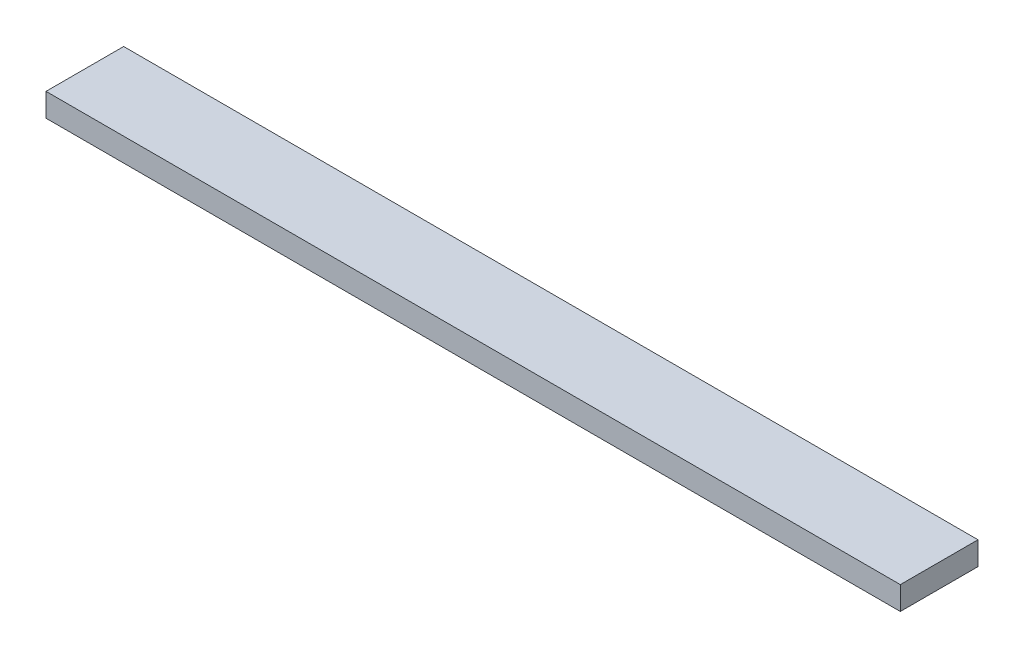
ISO-10303-21;
HEADER;
FILE_DESCRIPTION(('STEP AP214'),'2;1');
FILE_NAME('part.step','',(''),(''),'','','');
FILE_SCHEMA(('AUTOMOTIVE_DESIGN { 1 0 10303 214 1 1 1 1 }'));
ENDSEC;
DATA;
#1=APPLICATION_CONTEXT('core data for automotive mechanical design processes');
#2=APPLICATION_PROTOCOL_DEFINITION('international standard','automotive_design',2000,#1);
#3=PRODUCT_CONTEXT('',#1,'mechanical');
#4=PRODUCT('Part','Part','',(#3));
#5=PRODUCT_RELATED_PRODUCT_CATEGORY('part','',(#4));
#6=PRODUCT_DEFINITION_FORMATION('','',#4);
#7=PRODUCT_DEFINITION_CONTEXT('part definition',#1,'design');
#8=PRODUCT_DEFINITION('design','',#6,#7);
#9=PRODUCT_DEFINITION_SHAPE('','',#8);
#10=(LENGTH_UNIT() NAMED_UNIT(*) SI_UNIT(.MILLI.,.METRE.));
#11=(NAMED_UNIT(*) PLANE_ANGLE_UNIT() SI_UNIT($,.RADIAN.));
#12=(NAMED_UNIT(*) SI_UNIT($,.STERADIAN.) SOLID_ANGLE_UNIT());
#13=UNCERTAINTY_MEASURE_WITH_UNIT(LENGTH_MEASURE(1.E-05),#10,'distance_accuracy_value','');
#14=(GEOMETRIC_REPRESENTATION_CONTEXT(3) GLOBAL_UNCERTAINTY_ASSIGNED_CONTEXT((#13)) GLOBAL_UNIT_ASSIGNED_CONTEXT((#10,
#11,#12)) REPRESENTATION_CONTEXT('',''));
#15=CARTESIAN_POINT('',(0.,0.,0.));
#16=DIRECTION('',(0.,0.,1.));
#17=DIRECTION('',(1.,0.,0.));
#18=AXIS2_PLACEMENT_3D('',#15,#16,#17);
#19=CARTESIAN_POINT('',(0.,15.,0.));
#20=DIRECTION('',(1.,0.,0.));
#21=DIRECTION('',(0.,0.,-1.));
#22=AXIS2_PLACEMENT_3D('',#19,#20,#21);
#23=PLANE('',#22);
#24=DIRECTION('',(0.,0.,1.));
#25=VECTOR('',#24,1.);
#26=CARTESIAN_POINT('',(0.,0.,0.));
#27=LINE('',#26,#25);
#28=CARTESIAN_POINT('',(0.,0.,-50.));
#29=VERTEX_POINT('',#28);
#30=CARTESIAN_POINT('',(0.,0.,0.));
#31=VERTEX_POINT('',#30);
#32=EDGE_CURVE('E101',#29,#31,#27,.T.);
#33=ORIENTED_EDGE('',*,*,#32,.T.);
#34=DIRECTION('',(0.,-1.,0.));
#35=VECTOR('',#34,1.);
#36=CARTESIAN_POINT('',(0.,15.,0.));
#37=LINE('',#36,#35);
#38=CARTESIAN_POINT('',(0.,15.,0.));
#39=VERTEX_POINT('',#38);
#40=EDGE_CURVE('E11',#39,#31,#37,.T.);
#41=ORIENTED_EDGE('',*,*,#40,.F.);
#42=DIRECTION('',(0.,0.,1.));
#43=VECTOR('',#42,1.);
#44=CARTESIAN_POINT('',(0.,15.,0.));
#45=LINE('',#44,#43);
#46=CARTESIAN_POINT('',(0.,15.,-50.));
#47=VERTEX_POINT('',#46);
#48=EDGE_CURVE('E89',#47,#39,#45,.T.);
#49=ORIENTED_EDGE('',*,*,#48,.F.);
#50=DIRECTION('',(0.,-1.,0.));
#51=VECTOR('',#50,1.);
#52=CARTESIAN_POINT('',(0.,15.,-50.));
#53=LINE('',#52,#51);
#54=EDGE_CURVE('E97',#47,#29,#53,.T.);
#55=ORIENTED_EDGE('',*,*,#54,.T.);
#56=EDGE_LOOP('',(#33,#41,#49,#55));
#57=FACE_BOUND('',#56,.T.);
#58=ADVANCED_FACE('F38',(#57),#23,.F.);
#59=CARTESIAN_POINT('',(0.,15.,0.));
#60=DIRECTION('',(0.,0.,-1.));
#61=DIRECTION('',(-1.,0.,0.));
#62=AXIS2_PLACEMENT_3D('',#59,#60,#61);
#63=PLANE('',#62);
#64=DIRECTION('',(1.,0.,0.));
#65=VECTOR('',#64,1.);
#66=CARTESIAN_POINT('',(0.,0.,0.));
#67=LINE('',#66,#65);
#68=CARTESIAN_POINT('',(550.,0.,0.));
#69=VERTEX_POINT('',#68);
#70=EDGE_CURVE('E93',#31,#69,#67,.T.);
#71=ORIENTED_EDGE('',*,*,#70,.T.);
#72=DIRECTION('',(0.,-1.,0.));
#73=VECTOR('',#72,1.);
#74=CARTESIAN_POINT('',(550.,15.,0.));
#75=LINE('',#74,#73);
#76=CARTESIAN_POINT('',(550.,15.,0.));
#77=VERTEX_POINT('',#76);
#78=EDGE_CURVE('E46',#77,#69,#75,.T.);
#79=ORIENTED_EDGE('',*,*,#78,.F.);
#80=DIRECTION('',(1.,0.,0.));
#81=VECTOR('',#80,1.);
#82=CARTESIAN_POINT('',(0.,15.,0.));
#83=LINE('',#82,#81);
#84=EDGE_CURVE('E84',#39,#77,#83,.T.);
#85=ORIENTED_EDGE('',*,*,#84,.F.);
#86=ORIENTED_EDGE('',*,*,#40,.T.);
#87=EDGE_LOOP('',(#71,#79,#85,#86));
#88=FACE_BOUND('',#87,.T.);
#89=ADVANCED_FACE('F92',(#88),#63,.F.);
#90=CARTESIAN_POINT('',(550.,15.,0.));
#91=DIRECTION('',(-1.,0.,0.));
#92=DIRECTION('',(0.,0.,1.));
#93=AXIS2_PLACEMENT_3D('',#90,#91,#92);
#94=PLANE('',#93);
#95=DIRECTION('',(0.,0.,-1.));
#96=VECTOR('',#95,1.);
#97=CARTESIAN_POINT('',(550.,0.,0.));
#98=LINE('',#97,#96);
#99=CARTESIAN_POINT('',(550.,0.,-50.));
#100=VERTEX_POINT('',#99);
#101=EDGE_CURVE('E71',#69,#100,#98,.T.);
#102=ORIENTED_EDGE('',*,*,#101,.T.);
#103=DIRECTION('',(0.,-1.,0.));
#104=VECTOR('',#103,1.);
#105=CARTESIAN_POINT('',(550.,15.,-50.));
#106=LINE('',#105,#104);
#107=CARTESIAN_POINT('',(550.,15.,-50.));
#108=VERTEX_POINT('',#107);
#109=EDGE_CURVE('E94',#108,#100,#106,.T.);
#110=ORIENTED_EDGE('',*,*,#109,.F.);
#111=DIRECTION('',(0.,0.,-1.));
#112=VECTOR('',#111,1.);
#113=CARTESIAN_POINT('',(550.,15.,0.));
#114=LINE('',#113,#112);
#115=EDGE_CURVE('E87',#77,#108,#114,.T.);
#116=ORIENTED_EDGE('',*,*,#115,.F.);
#117=ORIENTED_EDGE('',*,*,#78,.T.);
#118=EDGE_LOOP('',(#102,#110,#116,#117));
#119=FACE_BOUND('',#118,.T.);
#120=ADVANCED_FACE('F95',(#119),#94,.F.);
#121=CARTESIAN_POINT('',(0.,15.,-50.));
#122=DIRECTION('',(0.,0.,1.));
#123=DIRECTION('',(1.,0.,0.));
#124=AXIS2_PLACEMENT_3D('',#121,#122,#123);
#125=PLANE('',#124);
#126=DIRECTION('',(-1.,0.,0.));
#127=VECTOR('',#126,1.);
#128=CARTESIAN_POINT('',(0.,0.,-50.));
#129=LINE('',#128,#127);
#130=EDGE_CURVE('E77',#100,#29,#129,.T.);
#131=ORIENTED_EDGE('',*,*,#130,.T.);
#132=ORIENTED_EDGE('',*,*,#54,.F.);
#133=DIRECTION('',(-1.,0.,0.));
#134=VECTOR('',#133,1.);
#135=CARTESIAN_POINT('',(0.,15.,-50.));
#136=LINE('',#135,#134);
#137=EDGE_CURVE('E54',#108,#47,#136,.T.);
#138=ORIENTED_EDGE('',*,*,#137,.F.);
#139=ORIENTED_EDGE('',*,*,#109,.T.);
#140=EDGE_LOOP('',(#131,#132,#138,#139));
#141=FACE_BOUND('',#140,.T.);
#142=ADVANCED_FACE('F108',(#141),#125,.F.);
#143=CARTESIAN_POINT('',(0.,15.,0.));
#144=DIRECTION('',(0.,-1.,0.));
#145=DIRECTION('',(0.,0.,-1.));
#146=AXIS2_PLACEMENT_3D('',#143,#144,#145);
#147=PLANE('',#146);
#148=ORIENTED_EDGE('',*,*,#48,.T.);
#149=ORIENTED_EDGE('',*,*,#84,.T.);
#150=ORIENTED_EDGE('',*,*,#115,.T.);
#151=ORIENTED_EDGE('',*,*,#137,.T.);
#152=EDGE_LOOP('',(#148,#149,#150,#151));
#153=FACE_BOUND('',#152,.T.);
#154=ADVANCED_FACE('F85',(#153),#147,.F.);
#155=CARTESIAN_POINT('',(0.,0.,0.));
#156=DIRECTION('',(0.,-1.,0.));
#157=DIRECTION('',(0.,0.,-1.));
#158=AXIS2_PLACEMENT_3D('',#155,#156,#157);
#159=PLANE('',#158);
#160=ORIENTED_EDGE('',*,*,#32,.F.);
#161=ORIENTED_EDGE('',*,*,#130,.F.);
#162=ORIENTED_EDGE('',*,*,#101,.F.);
#163=ORIENTED_EDGE('',*,*,#70,.F.);
#164=EDGE_LOOP('',(#160,#161,#162,#163));
#165=FACE_BOUND('',#164,.T.);
#166=ADVANCED_FACE('F111',(#165),#159,.T.);
#167=CLOSED_SHELL('',(#58,#89,#120,#142,#154,#166));
#168=MANIFOLD_SOLID_BREP('B2',#167);
#169=ADVANCED_BREP_SHAPE_REPRESENTATION('',(#18,#168),#14);
#170=SHAPE_DEFINITION_REPRESENTATION(#9,#169);
ENDSEC;
END-ISO-10303-21;
